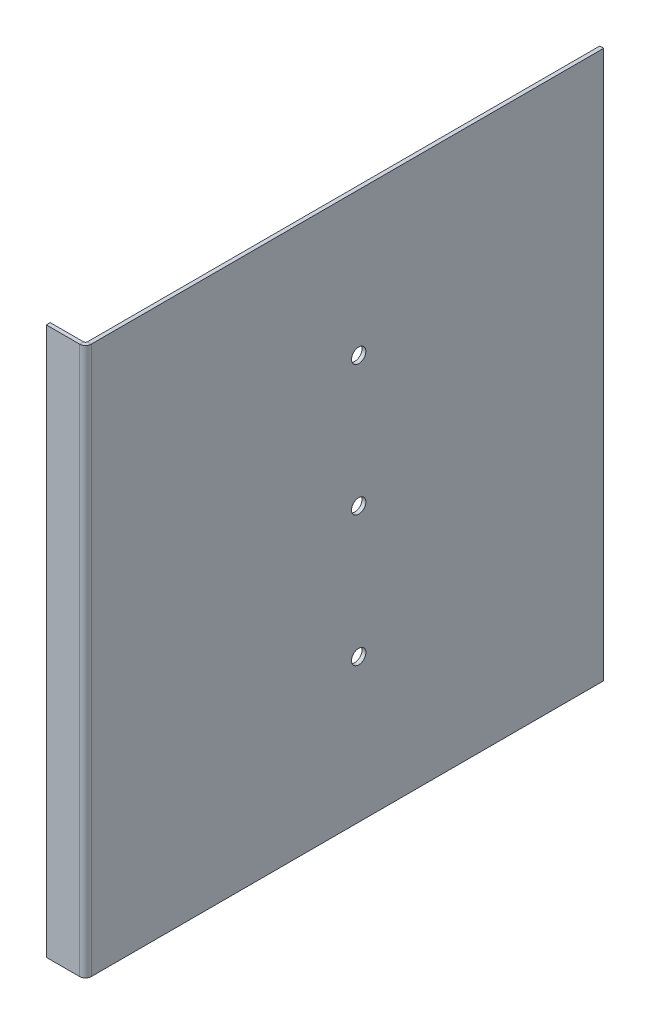
ISO-10303-21;
HEADER;
FILE_DESCRIPTION(('STEP AP214'),'2;1');
FILE_NAME('part.step','',(''),(''),'','','');
FILE_SCHEMA(('AUTOMOTIVE_DESIGN { 1 0 10303 214 1 1 1 1 }'));
ENDSEC;
DATA;
#1=APPLICATION_CONTEXT('core data for automotive mechanical design processes');
#2=APPLICATION_PROTOCOL_DEFINITION('international standard','automotive_design',2000,#1);
#3=PRODUCT_CONTEXT('',#1,'mechanical');
#4=PRODUCT('Part','Part','',(#3));
#5=PRODUCT_RELATED_PRODUCT_CATEGORY('part','',(#4));
#6=PRODUCT_DEFINITION_FORMATION('','',#4);
#7=PRODUCT_DEFINITION_CONTEXT('part definition',#1,'design');
#8=PRODUCT_DEFINITION('design','',#6,#7);
#9=PRODUCT_DEFINITION_SHAPE('','',#8);
#10=(LENGTH_UNIT() NAMED_UNIT(*) SI_UNIT(.MILLI.,.METRE.));
#11=(NAMED_UNIT(*) PLANE_ANGLE_UNIT() SI_UNIT($,.RADIAN.));
#12=(NAMED_UNIT(*) SI_UNIT($,.STERADIAN.) SOLID_ANGLE_UNIT());
#13=UNCERTAINTY_MEASURE_WITH_UNIT(LENGTH_MEASURE(1.E-05),#10,'distance_accuracy_value','');
#14=(GEOMETRIC_REPRESENTATION_CONTEXT(3) GLOBAL_UNCERTAINTY_ASSIGNED_CONTEXT((#13)) GLOBAL_UNIT_ASSIGNED_CONTEXT((#10,
#11,#12)) REPRESENTATION_CONTEXT('',''));
#15=CARTESIAN_POINT('',(0.,0.,0.));
#16=DIRECTION('',(0.,0.,1.));
#17=DIRECTION('',(1.,0.,0.));
#18=AXIS2_PLACEMENT_3D('',#15,#16,#17);
#19=CARTESIAN_POINT('',(1.5,0.,198.66));
#20=DIRECTION('',(-1.,0.,0.));
#21=DIRECTION('',(0.,0.,1.));
#22=AXIS2_PLACEMENT_3D('',#19,#20,#21);
#23=PLANE('',#22);
#24=CARTESIAN_POINT('',(1.5,55.,93.91));
#25=DIRECTION('',(1.,0.,0.));
#26=DIRECTION('',(0.,0.,-1.));
#27=AXIS2_PLACEMENT_3D('',#24,#25,#26);
#28=CIRCLE('',#27,2.75000000000001);
#29=CARTESIAN_POINT('',(1.5,55.,91.16));
#30=VERTEX_POINT('',#29);
#31=EDGE_CURVE('E195',#30,#30,#28,.T.);
#32=ORIENTED_EDGE('',*,*,#31,.F.);
#33=EDGE_LOOP('',(#32));
#34=FACE_BOUND('',#33,.T.);
#35=CARTESIAN_POINT('',(1.5,105.,93.91));
#36=DIRECTION('',(1.,0.,0.));
#37=DIRECTION('',(0.,0.,-1.));
#38=AXIS2_PLACEMENT_3D('',#35,#36,#37);
#39=CIRCLE('',#38,2.75000000000001);
#40=CARTESIAN_POINT('',(1.5,105.,91.16));
#41=VERTEX_POINT('',#40);
#42=EDGE_CURVE('E186',#41,#41,#39,.T.);
#43=ORIENTED_EDGE('',*,*,#42,.F.);
#44=EDGE_LOOP('',(#43));
#45=FACE_BOUND('',#44,.T.);
#46=CARTESIAN_POINT('',(1.5,155.,93.91));
#47=DIRECTION('',(1.,0.,0.));
#48=DIRECTION('',(0.,0.,-1.));
#49=AXIS2_PLACEMENT_3D('',#46,#47,#48);
#50=CIRCLE('',#49,2.75000000000001);
#51=CARTESIAN_POINT('',(1.5,155.,91.16));
#52=VERTEX_POINT('',#51);
#53=EDGE_CURVE('E189',#52,#52,#50,.T.);
#54=ORIENTED_EDGE('',*,*,#53,.F.);
#55=EDGE_LOOP('',(#54));
#56=FACE_BOUND('',#55,.T.);
#57=DIRECTION('',(0.,1.,0.));
#58=VECTOR('',#57,1.);
#59=CARTESIAN_POINT('',(1.5,210.,196.4234));
#60=LINE('',#59,#58);
#61=CARTESIAN_POINT('',(1.5,210.,196.4234));
#62=VERTEX_POINT('',#61);
#63=CARTESIAN_POINT('',(1.5,0.,196.4234));
#64=VERTEX_POINT('',#63);
#65=EDGE_CURVE('E129',#62,#64,#60,.F.);
#66=ORIENTED_EDGE('',*,*,#65,.T.);
#67=DIRECTION('',(0.,0.,-1.));
#68=VECTOR('',#67,1.);
#69=CARTESIAN_POINT('',(1.5,0.,198.66));
#70=LINE('',#69,#68);
#71=CARTESIAN_POINT('',(1.5,0.,0.));
#72=VERTEX_POINT('',#71);
#73=EDGE_CURVE('E211',#64,#72,#70,.T.);
#74=ORIENTED_EDGE('',*,*,#73,.T.);
#75=DIRECTION('',(0.,1.,0.));
#76=VECTOR('',#75,1.);
#77=CARTESIAN_POINT('',(1.5,0.,0.));
#78=LINE('',#77,#76);
#79=CARTESIAN_POINT('',(1.5,210.,0.));
#80=VERTEX_POINT('',#79);
#81=EDGE_CURVE('E199',#72,#80,#78,.T.);
#82=ORIENTED_EDGE('',*,*,#81,.T.);
#83=DIRECTION('',(0.,0.,-1.));
#84=VECTOR('',#83,1.);
#85=CARTESIAN_POINT('',(1.5,210.,198.66));
#86=LINE('',#85,#84);
#87=EDGE_CURVE('E13',#62,#80,#86,.T.);
#88=ORIENTED_EDGE('',*,*,#87,.F.);
#89=EDGE_LOOP('',(#66,#74,#82,#88));
#90=FACE_BOUND('',#89,.T.);
#91=ADVANCED_FACE('F56',(#34,#45,#56,#90),#23,.F.);
#92=CARTESIAN_POINT('',(0.,210.,198.66));
#93=DIRECTION('',(0.,1.,0.));
#94=DIRECTION('',(0.,0.,1.));
#95=AXIS2_PLACEMENT_3D('',#92,#93,#94);
#96=PLANE('',#95);
#97=DIRECTION('',(0.,0.,-1.));
#98=VECTOR('',#97,1.);
#99=CARTESIAN_POINT('',(0.,210.,198.66));
#100=LINE('',#99,#98);
#101=CARTESIAN_POINT('',(0.,210.,196.4234));
#102=VERTEX_POINT('',#101);
#103=CARTESIAN_POINT('',(0.,210.,0.));
#104=VERTEX_POINT('',#103);
#105=EDGE_CURVE('E64',#102,#104,#100,.T.);
#106=ORIENTED_EDGE('',*,*,#105,.F.);
#107=DIRECTION('',(1.,0.,0.));
#108=VECTOR('',#107,1.);
#109=CARTESIAN_POINT('',(0.,210.,196.4234));
#110=LINE('',#109,#108);
#111=EDGE_CURVE('E179',#102,#62,#110,.T.);
#112=ORIENTED_EDGE('',*,*,#111,.T.);
#113=ORIENTED_EDGE('',*,*,#87,.T.);
#114=DIRECTION('',(1.,0.,0.));
#115=VECTOR('',#114,1.);
#116=CARTESIAN_POINT('',(0.,210.,0.));
#117=LINE('',#116,#115);
#118=EDGE_CURVE('E202',#104,#80,#117,.T.);
#119=ORIENTED_EDGE('',*,*,#118,.F.);
#120=EDGE_LOOP('',(#106,#112,#113,#119));
#121=FACE_BOUND('',#120,.T.);
#122=ADVANCED_FACE('F230',(#121),#96,.T.);
#123=CARTESIAN_POINT('',(0.,0.,198.66));
#124=DIRECTION('',(-1.,0.,0.));
#125=DIRECTION('',(0.,0.,1.));
#126=AXIS2_PLACEMENT_3D('',#123,#124,#125);
#127=PLANE('',#126);
#128=CARTESIAN_POINT('',(0.,155.,93.91));
#129=DIRECTION('',(-1.,0.,0.));
#130=DIRECTION('',(0.,0.,1.));
#131=AXIS2_PLACEMENT_3D('',#128,#129,#130);
#132=CIRCLE('',#131,2.75000000000001);
#133=CARTESIAN_POINT('',(0.,155.,96.66));
#134=VERTEX_POINT('',#133);
#135=EDGE_CURVE('E59',#134,#134,#132,.T.);
#136=ORIENTED_EDGE('',*,*,#135,.F.);
#137=EDGE_LOOP('',(#136));
#138=FACE_BOUND('',#137,.T.);
#139=CARTESIAN_POINT('',(0.,105.,93.91));
#140=DIRECTION('',(-1.,0.,0.));
#141=DIRECTION('',(0.,0.,1.));
#142=AXIS2_PLACEMENT_3D('',#139,#140,#141);
#143=CIRCLE('',#142,2.75000000000001);
#144=CARTESIAN_POINT('',(0.,105.,96.66));
#145=VERTEX_POINT('',#144);
#146=EDGE_CURVE('E192',#145,#145,#143,.T.);
#147=ORIENTED_EDGE('',*,*,#146,.F.);
#148=EDGE_LOOP('',(#147));
#149=FACE_BOUND('',#148,.T.);
#150=CARTESIAN_POINT('',(0.,55.,93.91));
#151=DIRECTION('',(-1.,0.,0.));
#152=DIRECTION('',(0.,0.,1.));
#153=AXIS2_PLACEMENT_3D('',#150,#151,#152);
#154=CIRCLE('',#153,2.75000000000001);
#155=CARTESIAN_POINT('',(0.,55.,96.66));
#156=VERTEX_POINT('',#155);
#157=EDGE_CURVE('E198',#156,#156,#154,.T.);
#158=ORIENTED_EDGE('',*,*,#157,.F.);
#159=EDGE_LOOP('',(#158));
#160=FACE_BOUND('',#159,.T.);
#161=DIRECTION('',(0.,0.,-1.));
#162=VECTOR('',#161,1.);
#163=CARTESIAN_POINT('',(0.,0.,198.66));
#164=LINE('',#163,#162);
#165=CARTESIAN_POINT('',(0.,0.,196.4234));
#166=VERTEX_POINT('',#165);
#167=CARTESIAN_POINT('',(0.,0.,0.));
#168=VERTEX_POINT('',#167);
#169=EDGE_CURVE('E213',#166,#168,#164,.T.);
#170=ORIENTED_EDGE('',*,*,#169,.F.);
#171=DIRECTION('',(0.,1.,0.));
#172=VECTOR('',#171,1.);
#173=CARTESIAN_POINT('',(0.,210.,196.4234));
#174=LINE('',#173,#172);
#175=EDGE_CURVE('E72',#102,#166,#174,.F.);
#176=ORIENTED_EDGE('',*,*,#175,.F.);
#177=ORIENTED_EDGE('',*,*,#105,.T.);
#178=DIRECTION('',(0.,1.,0.));
#179=VECTOR('',#178,1.);
#180=CARTESIAN_POINT('',(0.,0.,0.));
#181=LINE('',#180,#179);
#182=EDGE_CURVE('E205',#168,#104,#181,.T.);
#183=ORIENTED_EDGE('',*,*,#182,.F.);
#184=EDGE_LOOP('',(#170,#176,#177,#183));
#185=FACE_BOUND('',#184,.T.);
#186=ADVANCED_FACE('F226',(#138,#149,#160,#185),#127,.T.);
#187=CARTESIAN_POINT('',(1.5,0.,198.66));
#188=DIRECTION('',(0.,-1.,0.));
#189=DIRECTION('',(0.,0.,-1.));
#190=AXIS2_PLACEMENT_3D('',#187,#188,#189);
#191=PLANE('',#190);
#192=DIRECTION('',(1.,0.,0.));
#193=VECTOR('',#192,1.);
#194=CARTESIAN_POINT('',(0.,0.,196.4234));
#195=LINE('',#194,#193);
#196=EDGE_CURVE('E80',#166,#64,#195,.T.);
#197=ORIENTED_EDGE('',*,*,#196,.F.);
#198=ORIENTED_EDGE('',*,*,#169,.T.);
#199=DIRECTION('',(-1.,0.,0.));
#200=VECTOR('',#199,1.);
#201=CARTESIAN_POINT('',(1.5,0.,0.));
#202=LINE('',#201,#200);
#203=EDGE_CURVE('E208',#72,#168,#202,.T.);
#204=ORIENTED_EDGE('',*,*,#203,.F.);
#205=ORIENTED_EDGE('',*,*,#73,.F.);
#206=EDGE_LOOP('',(#197,#198,#204,#205));
#207=FACE_BOUND('',#206,.T.);
#208=ADVANCED_FACE('F229',(#207),#191,.T.);
#209=CARTESIAN_POINT('',(0.,0.,0.));
#210=DIRECTION('',(0.,0.,-1.));
#211=DIRECTION('',(-1.,0.,0.));
#212=AXIS2_PLACEMENT_3D('',#209,#210,#211);
#213=PLANE('',#212);
#214=ORIENTED_EDGE('',*,*,#81,.F.);
#215=ORIENTED_EDGE('',*,*,#203,.T.);
#216=ORIENTED_EDGE('',*,*,#182,.T.);
#217=ORIENTED_EDGE('',*,*,#118,.T.);
#218=EDGE_LOOP('',(#214,#215,#216,#217));
#219=FACE_BOUND('',#218,.T.);
#220=ADVANCED_FACE('F274',(#219),#213,.T.);
#221=CARTESIAN_POINT('',(-8.5,55.,93.91));
#222=DIRECTION('',(1.,0.,0.));
#223=DIRECTION('',(0.,0.,-1.));
#224=AXIS2_PLACEMENT_3D('',#221,#222,#223);
#225=CYLINDRICAL_SURFACE('',#224,2.75000000000001);
#226=ORIENTED_EDGE('',*,*,#157,.T.);
#227=EDGE_LOOP('',(#226));
#228=FACE_BOUND('',#227,.T.);
#229=ORIENTED_EDGE('',*,*,#31,.T.);
#230=EDGE_LOOP('',(#229));
#231=FACE_BOUND('',#230,.T.);
#232=ADVANCED_FACE('F280',(#228,#231),#225,.F.);
#233=CARTESIAN_POINT('',(-8.5,105.,93.91));
#234=DIRECTION('',(1.,0.,0.));
#235=DIRECTION('',(0.,0.,-1.));
#236=AXIS2_PLACEMENT_3D('',#233,#234,#235);
#237=CYLINDRICAL_SURFACE('',#236,2.75000000000001);
#238=ORIENTED_EDGE('',*,*,#146,.T.);
#239=EDGE_LOOP('',(#238));
#240=FACE_BOUND('',#239,.T.);
#241=ORIENTED_EDGE('',*,*,#42,.T.);
#242=EDGE_LOOP('',(#241));
#243=FACE_BOUND('',#242,.T.);
#244=ADVANCED_FACE('F285',(#240,#243),#237,.F.);
#245=CARTESIAN_POINT('',(-8.5,155.,93.91));
#246=DIRECTION('',(1.,0.,0.));
#247=DIRECTION('',(0.,0.,-1.));
#248=AXIS2_PLACEMENT_3D('',#245,#246,#247);
#249=CYLINDRICAL_SURFACE('',#248,2.75000000000001);
#250=ORIENTED_EDGE('',*,*,#135,.T.);
#251=EDGE_LOOP('',(#250));
#252=FACE_BOUND('',#251,.T.);
#253=ORIENTED_EDGE('',*,*,#53,.T.);
#254=EDGE_LOOP('',(#253));
#255=FACE_BOUND('',#254,.T.);
#256=ADVANCED_FACE('F223',(#252,#255),#249,.F.);
#257=CARTESIAN_POINT('',(-0.736600000000004,0.,196.4234));
#258=DIRECTION('',(0.,-1.,0.));
#259=DIRECTION('',(0.,0.,-1.));
#260=AXIS2_PLACEMENT_3D('',#257,#258,#259);
#261=PLANE('',#260);
#262=DIRECTION('',(0.,0.,1.));
#263=VECTOR('',#262,1.);
#264=CARTESIAN_POINT('',(-0.736600000000004,0.,198.66));
#265=LINE('',#264,#263);
#266=CARTESIAN_POINT('',(-0.736600000000001,0.,197.16));
#267=VERTEX_POINT('',#266);
#268=CARTESIAN_POINT('',(-0.736599999999995,0.,198.66));
#269=VERTEX_POINT('',#268);
#270=EDGE_CURVE('E174',#267,#269,#265,.T.);
#271=ORIENTED_EDGE('',*,*,#270,.F.);
#272=CARTESIAN_POINT('',(-0.736600000000004,0.,196.4234));
#273=DIRECTION('',(0.,1.,0.));
#274=DIRECTION('',(0.,0.,1.));
#275=AXIS2_PLACEMENT_3D('',#272,#273,#274);
#276=CIRCLE('',#275,0.736600000000004);
#277=EDGE_CURVE('E132',#166,#267,#276,.F.);
#278=ORIENTED_EDGE('',*,*,#277,.F.);
#279=ORIENTED_EDGE('',*,*,#196,.T.);
#280=CARTESIAN_POINT('',(-0.736600000000004,0.,196.4234));
#281=DIRECTION('',(0.,1.,0.));
#282=DIRECTION('',(0.,0.,1.));
#283=AXIS2_PLACEMENT_3D('',#280,#281,#282);
#284=CIRCLE('',#283,2.2366);
#285=EDGE_CURVE('E178',#64,#269,#284,.F.);
#286=ORIENTED_EDGE('',*,*,#285,.T.);
#287=EDGE_LOOP('',(#271,#278,#279,#286));
#288=FACE_BOUND('',#287,.T.);
#289=ADVANCED_FACE('F241',(#288),#261,.T.);
#290=CARTESIAN_POINT('',(-0.736600000000004,210.,196.4234));
#291=DIRECTION('',(0.,-1.,0.));
#292=DIRECTION('',(0.,0.,-1.));
#293=AXIS2_PLACEMENT_3D('',#290,#291,#292);
#294=PLANE('',#293);
#295=CARTESIAN_POINT('',(-0.736600000000004,210.,196.4234));
#296=DIRECTION('',(0.,1.,0.));
#297=DIRECTION('',(0.,0.,1.));
#298=AXIS2_PLACEMENT_3D('',#295,#296,#297);
#299=CIRCLE('',#298,0.736600000000004);
#300=CARTESIAN_POINT('',(-0.736600000000001,210.,197.16));
#301=VERTEX_POINT('',#300);
#302=EDGE_CURVE('E139',#301,#102,#299,.T.);
#303=ORIENTED_EDGE('',*,*,#302,.F.);
#304=DIRECTION('',(0.,0.,1.));
#305=VECTOR('',#304,1.);
#306=CARTESIAN_POINT('',(-0.736600000000004,210.,197.16));
#307=LINE('',#306,#305);
#308=CARTESIAN_POINT('',(-0.736600000000004,210.,198.66));
#309=VERTEX_POINT('',#308);
#310=EDGE_CURVE('E136',#301,#309,#307,.T.);
#311=ORIENTED_EDGE('',*,*,#310,.T.);
#312=CARTESIAN_POINT('',(-0.736600000000004,210.,196.4234));
#313=DIRECTION('',(0.,1.,0.));
#314=DIRECTION('',(0.,0.,1.));
#315=AXIS2_PLACEMENT_3D('',#312,#313,#314);
#316=CIRCLE('',#315,2.2366);
#317=EDGE_CURVE('E121',#309,#62,#316,.T.);
#318=ORIENTED_EDGE('',*,*,#317,.T.);
#319=ORIENTED_EDGE('',*,*,#111,.F.);
#320=EDGE_LOOP('',(#303,#311,#318,#319));
#321=FACE_BOUND('',#320,.T.);
#322=ADVANCED_FACE('F137',(#321),#294,.F.);
#323=CARTESIAN_POINT('',(-0.736600000000004,210.,196.4234));
#324=DIRECTION('',(0.,1.,0.));
#325=DIRECTION('',(0.,0.,1.));
#326=AXIS2_PLACEMENT_3D('',#323,#324,#325);
#327=CYLINDRICAL_SURFACE('',#326,2.2366);
#328=ORIENTED_EDGE('',*,*,#65,.F.);
#329=ORIENTED_EDGE('',*,*,#317,.F.);
#330=DIRECTION('',(0.,1.,0.));
#331=VECTOR('',#330,1.);
#332=CARTESIAN_POINT('',(-0.736600000000004,0.,198.66));
#333=LINE('',#332,#331);
#334=EDGE_CURVE('E126',#269,#309,#333,.T.);
#335=ORIENTED_EDGE('',*,*,#334,.F.);
#336=ORIENTED_EDGE('',*,*,#285,.F.);
#337=EDGE_LOOP('',(#328,#329,#335,#336));
#338=FACE_BOUND('',#337,.T.);
#339=ADVANCED_FACE('F123',(#338),#327,.T.);
#340=CARTESIAN_POINT('',(-0.736600000000004,210.,196.4234));
#341=DIRECTION('',(0.,1.,0.));
#342=DIRECTION('',(0.,0.,1.));
#343=AXIS2_PLACEMENT_3D('',#340,#341,#342);
#344=CYLINDRICAL_SURFACE('',#343,0.736600000000004);
#345=ORIENTED_EDGE('',*,*,#175,.T.);
#346=ORIENTED_EDGE('',*,*,#277,.T.);
#347=DIRECTION('',(0.,-1.,0.));
#348=VECTOR('',#347,1.);
#349=CARTESIAN_POINT('',(-0.736600000000004,0.,197.16));
#350=LINE('',#349,#348);
#351=EDGE_CURVE('E144',#267,#301,#350,.F.);
#352=ORIENTED_EDGE('',*,*,#351,.T.);
#353=ORIENTED_EDGE('',*,*,#302,.T.);
#354=EDGE_LOOP('',(#345,#346,#352,#353));
#355=FACE_BOUND('',#354,.T.);
#356=ADVANCED_FACE('F238',(#355),#344,.F.);
#357=CARTESIAN_POINT('',(0.,210.,198.66));
#358=DIRECTION('',(0.,1.,0.));
#359=DIRECTION('',(0.,0.,1.));
#360=AXIS2_PLACEMENT_3D('',#357,#358,#359);
#361=PLANE('',#360);
#362=DIRECTION('',(1.,0.,0.));
#363=VECTOR('',#362,1.);
#364=CARTESIAN_POINT('',(0.,210.,198.66));
#365=LINE('',#364,#363);
#366=CARTESIAN_POINT('',(-13.5,210.,198.66));
#367=VERTEX_POINT('',#366);
#368=EDGE_CURVE('E151',#367,#309,#365,.T.);
#369=ORIENTED_EDGE('',*,*,#368,.T.);
#370=ORIENTED_EDGE('',*,*,#310,.F.);
#371=DIRECTION('',(-1.,0.,0.));
#372=VECTOR('',#371,1.);
#373=CARTESIAN_POINT('',(8.1687742989642E-13,210.,197.16));
#374=LINE('',#373,#372);
#375=CARTESIAN_POINT('',(-13.5,210.,197.16));
#376=VERTEX_POINT('',#375);
#377=EDGE_CURVE('E167',#376,#301,#374,.F.);
#378=ORIENTED_EDGE('',*,*,#377,.F.);
#379=DIRECTION('',(0.,0.,-1.));
#380=VECTOR('',#379,1.);
#381=CARTESIAN_POINT('',(-13.5,210.,198.66));
#382=LINE('',#381,#380);
#383=EDGE_CURVE('E156',#367,#376,#382,.T.);
#384=ORIENTED_EDGE('',*,*,#383,.F.);
#385=EDGE_LOOP('',(#369,#370,#378,#384));
#386=FACE_BOUND('',#385,.T.);
#387=ADVANCED_FACE('F155',(#386),#361,.T.);
#388=CARTESIAN_POINT('',(-13.5,0.,198.66));
#389=DIRECTION('',(0.,-1.,0.));
#390=DIRECTION('',(0.,0.,-1.));
#391=AXIS2_PLACEMENT_3D('',#388,#389,#390);
#392=PLANE('',#391);
#393=DIRECTION('',(1.,0.,0.));
#394=VECTOR('',#393,1.);
#395=CARTESIAN_POINT('',(8.1687742989642E-13,0.,197.16));
#396=LINE('',#395,#394);
#397=CARTESIAN_POINT('',(-13.5,0.,197.16));
#398=VERTEX_POINT('',#397);
#399=EDGE_CURVE('E153',#267,#398,#396,.F.);
#400=ORIENTED_EDGE('',*,*,#399,.F.);
#401=ORIENTED_EDGE('',*,*,#270,.T.);
#402=DIRECTION('',(-1.,0.,0.));
#403=VECTOR('',#402,1.);
#404=CARTESIAN_POINT('',(-13.5,0.,198.66));
#405=LINE('',#404,#403);
#406=CARTESIAN_POINT('',(-13.5,0.,198.66));
#407=VERTEX_POINT('',#406);
#408=EDGE_CURVE('E152',#269,#407,#405,.T.);
#409=ORIENTED_EDGE('',*,*,#408,.T.);
#410=DIRECTION('',(0.,0.,-1.));
#411=VECTOR('',#410,1.);
#412=CARTESIAN_POINT('',(-13.5,0.,198.66));
#413=LINE('',#412,#411);
#414=EDGE_CURVE('E158',#407,#398,#413,.T.);
#415=ORIENTED_EDGE('',*,*,#414,.T.);
#416=EDGE_LOOP('',(#400,#401,#409,#415));
#417=FACE_BOUND('',#416,.T.);
#418=ADVANCED_FACE('F244',(#417),#392,.T.);
#419=CARTESIAN_POINT('',(8.22114651904685E-13,0.,198.66));
#420=DIRECTION('',(0.,0.,1.));
#421=DIRECTION('',(1.,0.,0.));
#422=AXIS2_PLACEMENT_3D('',#419,#420,#421);
#423=PLANE('',#422);
#424=ORIENTED_EDGE('',*,*,#408,.F.);
#425=ORIENTED_EDGE('',*,*,#334,.T.);
#426=ORIENTED_EDGE('',*,*,#368,.F.);
#427=DIRECTION('',(0.,1.,0.));
#428=VECTOR('',#427,1.);
#429=CARTESIAN_POINT('',(-13.5,210.,198.66));
#430=LINE('',#429,#428);
#431=EDGE_CURVE('E159',#407,#367,#430,.T.);
#432=ORIENTED_EDGE('',*,*,#431,.F.);
#433=EDGE_LOOP('',(#424,#425,#426,#432));
#434=FACE_BOUND('',#433,.T.);
#435=ADVANCED_FACE('F149',(#434),#423,.T.);
#436=CARTESIAN_POINT('',(8.1687742989642E-13,0.,197.16));
#437=DIRECTION('',(0.,0.,1.));
#438=DIRECTION('',(1.,0.,0.));
#439=AXIS2_PLACEMENT_3D('',#436,#437,#438);
#440=PLANE('',#439);
#441=ORIENTED_EDGE('',*,*,#351,.F.);
#442=ORIENTED_EDGE('',*,*,#399,.T.);
#443=DIRECTION('',(0.,-1.,0.));
#444=VECTOR('',#443,1.);
#445=CARTESIAN_POINT('',(-13.5,0.,197.16));
#446=LINE('',#445,#444);
#447=EDGE_CURVE('E169',#398,#376,#446,.F.);
#448=ORIENTED_EDGE('',*,*,#447,.T.);
#449=ORIENTED_EDGE('',*,*,#377,.T.);
#450=EDGE_LOOP('',(#441,#442,#448,#449));
#451=FACE_BOUND('',#450,.T.);
#452=ADVANCED_FACE('F248',(#451),#440,.F.);
#453=CARTESIAN_POINT('',(-13.5,210.,198.66));
#454=DIRECTION('',(-1.,0.,0.));
#455=DIRECTION('',(0.,0.,1.));
#456=AXIS2_PLACEMENT_3D('',#453,#454,#455);
#457=PLANE('',#456);
#458=ORIENTED_EDGE('',*,*,#447,.F.);
#459=ORIENTED_EDGE('',*,*,#414,.F.);
#460=ORIENTED_EDGE('',*,*,#431,.T.);
#461=ORIENTED_EDGE('',*,*,#383,.T.);
#462=EDGE_LOOP('',(#458,#459,#460,#461));
#463=FACE_BOUND('',#462,.T.);
#464=ADVANCED_FACE('F250',(#463),#457,.T.);
#465=CLOSED_SHELL('',(#91,#122,#186,#208,#220,#232,#244,#256,#289,#322,#339,#356,#387,#418,#435,
#452,#464));
#466=MANIFOLD_SOLID_BREP('B2',#465);
#467=ADVANCED_BREP_SHAPE_REPRESENTATION('',(#18,#466),#14);
#468=SHAPE_DEFINITION_REPRESENTATION(#9,#467);
ENDSEC;
END-ISO-10303-21;
